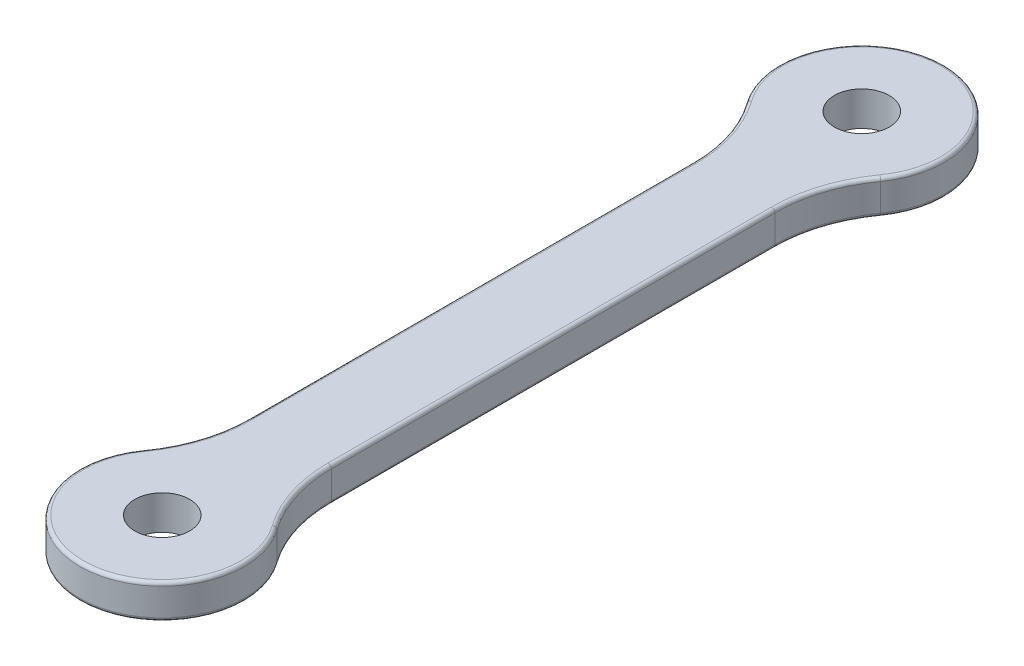
ISO-10303-21;
HEADER;
FILE_DESCRIPTION(('STEP AP214'),'2;1');
FILE_NAME('part.step','',(''),(''),'','','');
FILE_SCHEMA(('AUTOMOTIVE_DESIGN { 1 0 10303 214 1 1 1 1 }'));
ENDSEC;
DATA;
#1=APPLICATION_CONTEXT('core data for automotive mechanical design processes');
#2=APPLICATION_PROTOCOL_DEFINITION('international standard','automotive_design',2000,#1);
#3=PRODUCT_CONTEXT('',#1,'mechanical');
#4=PRODUCT('Part','Part','',(#3));
#5=PRODUCT_RELATED_PRODUCT_CATEGORY('part','',(#4));
#6=PRODUCT_DEFINITION_FORMATION('','',#4);
#7=PRODUCT_DEFINITION_CONTEXT('part definition',#1,'design');
#8=PRODUCT_DEFINITION('design','',#6,#7);
#9=PRODUCT_DEFINITION_SHAPE('','',#8);
#10=(LENGTH_UNIT() NAMED_UNIT(*) SI_UNIT(.MILLI.,.METRE.));
#11=(NAMED_UNIT(*) PLANE_ANGLE_UNIT() SI_UNIT($,.RADIAN.));
#12=(NAMED_UNIT(*) SI_UNIT($,.STERADIAN.) SOLID_ANGLE_UNIT());
#13=UNCERTAINTY_MEASURE_WITH_UNIT(LENGTH_MEASURE(1.E-05),#10,'distance_accuracy_value','');
#14=(GEOMETRIC_REPRESENTATION_CONTEXT(3) GLOBAL_UNCERTAINTY_ASSIGNED_CONTEXT((#13)) GLOBAL_UNIT_ASSIGNED_CONTEXT((#10,
#11,#12)) REPRESENTATION_CONTEXT('',''));
#15=CARTESIAN_POINT('',(0.,0.,0.));
#16=DIRECTION('',(0.,0.,1.));
#17=DIRECTION('',(1.,0.,0.));
#18=AXIS2_PLACEMENT_3D('',#15,#16,#17);
#19=CARTESIAN_POINT('',(0.,2.5,25.5));
#20=DIRECTION('',(0.,-1.,0.));
#21=DIRECTION('',(0.,0.,-1.));
#22=AXIS2_PLACEMENT_3D('',#19,#20,#21);
#23=CYLINDRICAL_SURFACE('',#22,6.);
#24=DIRECTION('',(0.,-1.,0.));
#25=VECTOR('',#24,1.);
#26=CARTESIAN_POINT('',(4.87500000000001,2.5,22.0022328550917));
#27=LINE('',#26,#25);
#28=CARTESIAN_POINT('',(4.87500000000001,0.25,22.0022328550917));
#29=VERTEX_POINT('',#28);
#30=CARTESIAN_POINT('',(4.87500000000001,2.25,22.0022328550917));
#31=VERTEX_POINT('',#30);
#32=EDGE_CURVE('E298',#29,#31,#27,.F.);
#33=ORIENTED_EDGE('',*,*,#32,.T.);
#34=CARTESIAN_POINT('',(0.,2.25,25.5));
#35=DIRECTION('',(0.,1.,0.));
#36=DIRECTION('',(0.,0.,1.));
#37=AXIS2_PLACEMENT_3D('',#34,#35,#36);
#38=CIRCLE('',#37,6.);
#39=CARTESIAN_POINT('',(-4.875,2.25,22.0022328550917));
#40=VERTEX_POINT('',#39);
#41=EDGE_CURVE('E192',#31,#40,#38,.F.);
#42=ORIENTED_EDGE('',*,*,#41,.T.);
#43=DIRECTION('',(0.,-1.,0.));
#44=VECTOR('',#43,1.);
#45=CARTESIAN_POINT('',(-4.875,2.5,22.0022328550917));
#46=LINE('',#45,#44);
#47=CARTESIAN_POINT('',(-4.875,0.25,22.0022328550917));
#48=VERTEX_POINT('',#47);
#49=EDGE_CURVE('E293',#40,#48,#46,.T.);
#50=ORIENTED_EDGE('',*,*,#49,.T.);
#51=CARTESIAN_POINT('',(0.,0.25,25.5));
#52=DIRECTION('',(0.,1.,0.));
#53=DIRECTION('',(0.,0.,1.));
#54=AXIS2_PLACEMENT_3D('',#51,#52,#53);
#55=CIRCLE('',#54,6.);
#56=EDGE_CURVE('E190',#48,#29,#55,.T.);
#57=ORIENTED_EDGE('',*,*,#56,.T.);
#58=EDGE_LOOP('',(#33,#42,#50,#57));
#59=FACE_BOUND('',#58,.T.);
#60=ADVANCED_FACE('F38',(#59),#23,.T.);
#61=CARTESIAN_POINT('',(3.,2.5,0.));
#62=DIRECTION('',(-1.,0.,0.));
#63=DIRECTION('',(0.,0.,1.));
#64=AXIS2_PLACEMENT_3D('',#61,#62,#63);
#65=PLANE('',#64);
#66=DIRECTION('',(0.,1.,0.));
#67=VECTOR('',#66,1.);
#68=CARTESIAN_POINT('',(3.,2.5,-16.1726209469112));
#69=LINE('',#68,#67);
#70=CARTESIAN_POINT('',(3.,0.25,-16.1726209469112));
#71=VERTEX_POINT('',#70);
#72=CARTESIAN_POINT('',(3.,2.25,-16.1726209469112));
#73=VERTEX_POINT('',#72);
#74=EDGE_CURVE('E174',#71,#73,#69,.T.);
#75=ORIENTED_EDGE('',*,*,#74,.T.);
#76=DIRECTION('',(0.,0.,-1.));
#77=VECTOR('',#76,1.);
#78=CARTESIAN_POINT('',(3.,2.25,16.1726209469112));
#79=LINE('',#78,#77);
#80=CARTESIAN_POINT('',(3.,2.25,16.1726209469112));
#81=VERTEX_POINT('',#80);
#82=EDGE_CURVE('E11',#73,#81,#79,.F.);
#83=ORIENTED_EDGE('',*,*,#82,.T.);
#84=DIRECTION('',(0.,1.,0.));
#85=VECTOR('',#84,1.);
#86=CARTESIAN_POINT('',(3.,0.,16.1726209469112));
#87=LINE('',#86,#85);
#88=CARTESIAN_POINT('',(3.,0.25,16.1726209469112));
#89=VERTEX_POINT('',#88);
#90=EDGE_CURVE('E305',#81,#89,#87,.F.);
#91=ORIENTED_EDGE('',*,*,#90,.T.);
#92=DIRECTION('',(0.,0.,-1.));
#93=VECTOR('',#92,1.);
#94=CARTESIAN_POINT('',(3.,0.25,0.));
#95=LINE('',#94,#93);
#96=EDGE_CURVE('E47',#89,#71,#95,.T.);
#97=ORIENTED_EDGE('',*,*,#96,.T.);
#98=EDGE_LOOP('',(#75,#83,#91,#97));
#99=FACE_BOUND('',#98,.T.);
#100=ADVANCED_FACE('F371',(#99),#65,.F.);
#101=CARTESIAN_POINT('',(0.,2.5,-25.5));
#102=DIRECTION('',(0.,-1.,0.));
#103=DIRECTION('',(0.,0.,-1.));
#104=AXIS2_PLACEMENT_3D('',#101,#102,#103);
#105=CYLINDRICAL_SURFACE('',#104,6.);
#106=DIRECTION('',(0.,-1.,0.));
#107=VECTOR('',#106,1.);
#108=CARTESIAN_POINT('',(-4.875,2.5,-22.0022328550917));
#109=LINE('',#108,#107);
#110=CARTESIAN_POINT('',(-4.875,0.25,-22.0022328550917));
#111=VERTEX_POINT('',#110);
#112=CARTESIAN_POINT('',(-4.875,2.25,-22.0022328550917));
#113=VERTEX_POINT('',#112);
#114=EDGE_CURVE('E286',#111,#113,#109,.F.);
#115=ORIENTED_EDGE('',*,*,#114,.T.);
#116=CARTESIAN_POINT('',(0.,2.25,-25.5));
#117=DIRECTION('',(0.,1.,0.));
#118=DIRECTION('',(0.,0.,1.));
#119=AXIS2_PLACEMENT_3D('',#116,#117,#118);
#120=CIRCLE('',#119,6.);
#121=CARTESIAN_POINT('',(4.87500000000001,2.25,-22.0022328550917));
#122=VERTEX_POINT('',#121);
#123=EDGE_CURVE('E208',#113,#122,#120,.F.);
#124=ORIENTED_EDGE('',*,*,#123,.T.);
#125=DIRECTION('',(0.,-1.,0.));
#126=VECTOR('',#125,1.);
#127=CARTESIAN_POINT('',(4.87500000000001,2.5,-22.0022328550917));
#128=LINE('',#127,#126);
#129=CARTESIAN_POINT('',(4.87500000000001,0.25,-22.0022328550917));
#130=VERTEX_POINT('',#129);
#131=EDGE_CURVE('E295',#122,#130,#128,.T.);
#132=ORIENTED_EDGE('',*,*,#131,.T.);
#133=CARTESIAN_POINT('',(0.,0.25,-25.5));
#134=DIRECTION('',(0.,1.,0.));
#135=DIRECTION('',(0.,0.,1.));
#136=AXIS2_PLACEMENT_3D('',#133,#134,#135);
#137=CIRCLE('',#136,6.);
#138=EDGE_CURVE('E206',#130,#111,#137,.T.);
#139=ORIENTED_EDGE('',*,*,#138,.T.);
#140=EDGE_LOOP('',(#115,#124,#132,#139));
#141=FACE_BOUND('',#140,.T.);
#142=ADVANCED_FACE('F376',(#141),#105,.T.);
#143=CARTESIAN_POINT('',(0.,2.5,25.5));
#144=DIRECTION('',(0.,-1.,0.));
#145=DIRECTION('',(0.,0.,-1.));
#146=AXIS2_PLACEMENT_3D('',#143,#144,#145);
#147=CYLINDRICAL_SURFACE('',#146,2.);
#148=CARTESIAN_POINT('',(0.,2.5,25.5));
#149=DIRECTION('',(0.,1.,0.));
#150=DIRECTION('',(0.,0.,1.));
#151=AXIS2_PLACEMENT_3D('',#148,#149,#150);
#152=CIRCLE('',#151,2.);
#153=CARTESIAN_POINT('',(0.,2.5,27.5));
#154=VERTEX_POINT('',#153);
#155=EDGE_CURVE('E336',#154,#154,#152,.T.);
#156=ORIENTED_EDGE('',*,*,#155,.T.);
#157=EDGE_LOOP('',(#156));
#158=FACE_BOUND('',#157,.T.);
#159=CARTESIAN_POINT('',(0.,0.,25.5));
#160=DIRECTION('',(0.,1.,0.));
#161=DIRECTION('',(0.,0.,1.));
#162=AXIS2_PLACEMENT_3D('',#159,#160,#161);
#163=CIRCLE('',#162,2.);
#164=CARTESIAN_POINT('',(0.,0.,27.5));
#165=VERTEX_POINT('',#164);
#166=EDGE_CURVE('E247',#165,#165,#163,.T.);
#167=ORIENTED_EDGE('',*,*,#166,.F.);
#168=EDGE_LOOP('',(#167));
#169=FACE_BOUND('',#168,.T.);
#170=ADVANCED_FACE('F347',(#158,#169),#147,.F.);
#171=CARTESIAN_POINT('',(-3.,2.5,0.));
#172=DIRECTION('',(-1.,0.,0.));
#173=DIRECTION('',(0.,0.,1.));
#174=AXIS2_PLACEMENT_3D('',#171,#172,#173);
#175=PLANE('',#174);
#176=DIRECTION('',(0.,-1.,0.));
#177=VECTOR('',#176,1.);
#178=CARTESIAN_POINT('',(-3.,2.5,16.1726209469112));
#179=LINE('',#178,#177);
#180=CARTESIAN_POINT('',(-3.,0.25,16.1726209469112));
#181=VERTEX_POINT('',#180);
#182=CARTESIAN_POINT('',(-3.,2.25,16.1726209469112));
#183=VERTEX_POINT('',#182);
#184=EDGE_CURVE('E292',#181,#183,#179,.F.);
#185=ORIENTED_EDGE('',*,*,#184,.T.);
#186=DIRECTION('',(0.,0.,-1.));
#187=VECTOR('',#186,1.);
#188=CARTESIAN_POINT('',(-3.,2.25,0.));
#189=LINE('',#188,#187);
#190=CARTESIAN_POINT('',(-3.,2.25,-16.1726209469112));
#191=VERTEX_POINT('',#190);
#192=EDGE_CURVE('E200',#183,#191,#189,.T.);
#193=ORIENTED_EDGE('',*,*,#192,.T.);
#194=DIRECTION('',(0.,-1.,0.));
#195=VECTOR('',#194,1.);
#196=CARTESIAN_POINT('',(-3.,2.5,-16.1726209469112));
#197=LINE('',#196,#195);
#198=CARTESIAN_POINT('',(-3.,0.25,-16.1726209469112));
#199=VERTEX_POINT('',#198);
#200=EDGE_CURVE('E283',#191,#199,#197,.T.);
#201=ORIENTED_EDGE('',*,*,#200,.T.);
#202=DIRECTION('',(0.,0.,-1.));
#203=VECTOR('',#202,1.);
#204=CARTESIAN_POINT('',(-3.,0.25,16.1726209469112));
#205=LINE('',#204,#203);
#206=EDGE_CURVE('E198',#199,#181,#205,.F.);
#207=ORIENTED_EDGE('',*,*,#206,.T.);
#208=EDGE_LOOP('',(#185,#193,#201,#207));
#209=FACE_BOUND('',#208,.T.);
#210=ADVANCED_FACE('F289',(#209),#175,.T.);
#211=CARTESIAN_POINT('',(0.,2.5,-25.5));
#212=DIRECTION('',(0.,-1.,0.));
#213=DIRECTION('',(0.,0.,-1.));
#214=AXIS2_PLACEMENT_3D('',#211,#212,#213);
#215=CYLINDRICAL_SURFACE('',#214,2.);
#216=CARTESIAN_POINT('',(0.,2.5,-25.5));
#217=DIRECTION('',(0.,1.,0.));
#218=DIRECTION('',(0.,0.,1.));
#219=AXIS2_PLACEMENT_3D('',#216,#217,#218);
#220=CIRCLE('',#219,2.);
#221=CARTESIAN_POINT('',(0.,2.5,-23.5));
#222=VERTEX_POINT('',#221);
#223=EDGE_CURVE('E334',#222,#222,#220,.T.);
#224=ORIENTED_EDGE('',*,*,#223,.T.);
#225=EDGE_LOOP('',(#224));
#226=FACE_BOUND('',#225,.T.);
#227=CARTESIAN_POINT('',(0.,0.,-25.5));
#228=DIRECTION('',(0.,1.,0.));
#229=DIRECTION('',(0.,0.,1.));
#230=AXIS2_PLACEMENT_3D('',#227,#228,#229);
#231=CIRCLE('',#230,2.);
#232=CARTESIAN_POINT('',(0.,0.,-23.5));
#233=VERTEX_POINT('',#232);
#234=EDGE_CURVE('E339',#233,#233,#231,.T.);
#235=ORIENTED_EDGE('',*,*,#234,.F.);
#236=EDGE_LOOP('',(#235));
#237=FACE_BOUND('',#236,.T.);
#238=ADVANCED_FACE('F352',(#226,#237),#215,.F.);
#239=CARTESIAN_POINT('',(0.,2.5,0.));
#240=DIRECTION('',(0.,1.,0.));
#241=DIRECTION('',(0.,0.,1.));
#242=AXIS2_PLACEMENT_3D('',#239,#240,#241);
#243=PLANE('',#242);
#244=CARTESIAN_POINT('',(0.,2.5,25.5));
#245=DIRECTION('',(0.,1.,0.));
#246=DIRECTION('',(0.,0.,1.));
#247=AXIS2_PLACEMENT_3D('',#244,#245,#246);
#248=CIRCLE('',#247,5.75);
#249=CARTESIAN_POINT('',(-4.671875,2.5,22.1479731527962));
#250=VERTEX_POINT('',#249);
#251=CARTESIAN_POINT('',(4.671875,2.5,22.1479731527962));
#252=VERTEX_POINT('',#251);
#253=EDGE_CURVE('E179',#250,#252,#248,.T.);
#254=ORIENTED_EDGE('',*,*,#253,.T.);
#255=CARTESIAN_POINT('',(13.,2.5,16.1726209469112));
#256=DIRECTION('',(0.,1.,0.));
#257=DIRECTION('',(0.,0.,1.));
#258=AXIS2_PLACEMENT_3D('',#255,#256,#257);
#259=CIRCLE('',#258,10.25);
#260=CARTESIAN_POINT('',(2.75,2.5,16.1726209469112));
#261=VERTEX_POINT('',#260);
#262=EDGE_CURVE('E159',#252,#261,#259,.F.);
#263=ORIENTED_EDGE('',*,*,#262,.T.);
#264=DIRECTION('',(0.,0.,-1.));
#265=VECTOR('',#264,1.);
#266=CARTESIAN_POINT('',(2.75,2.5,-16.1726209469112));
#267=LINE('',#266,#265);
#268=CARTESIAN_POINT('',(2.75,2.5,-16.1726209469112));
#269=VERTEX_POINT('',#268);
#270=EDGE_CURVE('E167',#261,#269,#267,.T.);
#271=ORIENTED_EDGE('',*,*,#270,.T.);
#272=CARTESIAN_POINT('',(13.,2.5,-16.1726209469112));
#273=DIRECTION('',(0.,1.,0.));
#274=DIRECTION('',(0.,0.,1.));
#275=AXIS2_PLACEMENT_3D('',#272,#273,#274);
#276=CIRCLE('',#275,10.25);
#277=CARTESIAN_POINT('',(4.671875,2.5,-22.1479731527962));
#278=VERTEX_POINT('',#277);
#279=EDGE_CURVE('E173',#269,#278,#276,.F.);
#280=ORIENTED_EDGE('',*,*,#279,.T.);
#281=CARTESIAN_POINT('',(0.,2.5,-25.5));
#282=DIRECTION('',(0.,1.,0.));
#283=DIRECTION('',(0.,0.,1.));
#284=AXIS2_PLACEMENT_3D('',#281,#282,#283);
#285=CIRCLE('',#284,5.75);
#286=CARTESIAN_POINT('',(-4.671875,2.5,-22.1479731527962));
#287=VERTEX_POINT('',#286);
#288=EDGE_CURVE('E311',#278,#287,#285,.T.);
#289=ORIENTED_EDGE('',*,*,#288,.T.);
#290=CARTESIAN_POINT('',(-13.,2.5,-16.1726209469112));
#291=DIRECTION('',(0.,1.,0.));
#292=DIRECTION('',(0.,0.,1.));
#293=AXIS2_PLACEMENT_3D('',#290,#291,#292);
#294=CIRCLE('',#293,10.25);
#295=CARTESIAN_POINT('',(-2.75,2.5,-16.1726209469112));
#296=VERTEX_POINT('',#295);
#297=EDGE_CURVE('E313',#287,#296,#294,.F.);
#298=ORIENTED_EDGE('',*,*,#297,.T.);
#299=DIRECTION('',(0.,0.,-1.));
#300=VECTOR('',#299,1.);
#301=CARTESIAN_POINT('',(-2.75,2.5,0.));
#302=LINE('',#301,#300);
#303=CARTESIAN_POINT('',(-2.75,2.5,16.1726209469112));
#304=VERTEX_POINT('',#303);
#305=EDGE_CURVE('E315',#296,#304,#302,.F.);
#306=ORIENTED_EDGE('',*,*,#305,.T.);
#307=CARTESIAN_POINT('',(-13.,2.5,16.1726209469112));
#308=DIRECTION('',(0.,1.,0.));
#309=DIRECTION('',(0.,0.,1.));
#310=AXIS2_PLACEMENT_3D('',#307,#308,#309);
#311=CIRCLE('',#310,10.25);
#312=EDGE_CURVE('E185',#304,#250,#311,.F.);
#313=ORIENTED_EDGE('',*,*,#312,.T.);
#314=EDGE_LOOP('',(#254,#263,#271,#280,#289,#298,#306,#313));
#315=FACE_BOUND('',#314,.T.);
#316=ORIENTED_EDGE('',*,*,#155,.F.);
#317=EDGE_LOOP('',(#316));
#318=FACE_BOUND('',#317,.T.);
#319=ORIENTED_EDGE('',*,*,#223,.F.);
#320=EDGE_LOOP('',(#319));
#321=FACE_BOUND('',#320,.T.);
#322=ADVANCED_FACE('F176',(#315,#318,#321),#243,.T.);
#323=CARTESIAN_POINT('',(0.,0.,0.));
#324=DIRECTION('',(0.,1.,0.));
#325=DIRECTION('',(0.,0.,1.));
#326=AXIS2_PLACEMENT_3D('',#323,#324,#325);
#327=PLANE('',#326);
#328=DIRECTION('',(0.,0.,-1.));
#329=VECTOR('',#328,1.);
#330=CARTESIAN_POINT('',(2.75,0.,0.));
#331=LINE('',#330,#329);
#332=CARTESIAN_POINT('',(2.75,0.,-16.1726209469112));
#333=VERTEX_POINT('',#332);
#334=CARTESIAN_POINT('',(2.75,0.,16.1726209469112));
#335=VERTEX_POINT('',#334);
#336=EDGE_CURVE('E214',#333,#335,#331,.F.);
#337=ORIENTED_EDGE('',*,*,#336,.T.);
#338=CARTESIAN_POINT('',(13.,0.,16.1726209469112));
#339=DIRECTION('',(0.,1.,0.));
#340=DIRECTION('',(0.,0.,1.));
#341=AXIS2_PLACEMENT_3D('',#338,#339,#340);
#342=CIRCLE('',#341,10.25);
#343=CARTESIAN_POINT('',(4.671875,0.,22.1479731527962));
#344=VERTEX_POINT('',#343);
#345=EDGE_CURVE('E227',#335,#344,#342,.T.);
#346=ORIENTED_EDGE('',*,*,#345,.T.);
#347=CARTESIAN_POINT('',(0.,0.,25.5));
#348=DIRECTION('',(0.,1.,0.));
#349=DIRECTION('',(0.,0.,1.));
#350=AXIS2_PLACEMENT_3D('',#347,#348,#349);
#351=CIRCLE('',#350,5.75);
#352=CARTESIAN_POINT('',(-4.671875,0.,22.1479731527962));
#353=VERTEX_POINT('',#352);
#354=EDGE_CURVE('E62',#344,#353,#351,.F.);
#355=ORIENTED_EDGE('',*,*,#354,.T.);
#356=CARTESIAN_POINT('',(-13.,0.,16.1726209469112));
#357=DIRECTION('',(0.,1.,0.));
#358=DIRECTION('',(0.,0.,1.));
#359=AXIS2_PLACEMENT_3D('',#356,#357,#358);
#360=CIRCLE('',#359,10.25);
#361=CARTESIAN_POINT('',(-2.75,0.,16.1726209469112));
#362=VERTEX_POINT('',#361);
#363=EDGE_CURVE('E224',#353,#362,#360,.T.);
#364=ORIENTED_EDGE('',*,*,#363,.T.);
#365=DIRECTION('',(0.,0.,-1.));
#366=VECTOR('',#365,1.);
#367=CARTESIAN_POINT('',(-2.75,0.,-16.1726209469112));
#368=LINE('',#367,#366);
#369=CARTESIAN_POINT('',(-2.75,0.,-16.1726209469112));
#370=VERTEX_POINT('',#369);
#371=EDGE_CURVE('E222',#362,#370,#368,.T.);
#372=ORIENTED_EDGE('',*,*,#371,.T.);
#373=CARTESIAN_POINT('',(-13.,0.,-16.1726209469112));
#374=DIRECTION('',(0.,1.,0.));
#375=DIRECTION('',(0.,0.,1.));
#376=AXIS2_PLACEMENT_3D('',#373,#374,#375);
#377=CIRCLE('',#376,10.25);
#378=CARTESIAN_POINT('',(-4.671875,0.,-22.1479731527962));
#379=VERTEX_POINT('',#378);
#380=EDGE_CURVE('E220',#370,#379,#377,.T.);
#381=ORIENTED_EDGE('',*,*,#380,.T.);
#382=CARTESIAN_POINT('',(0.,0.,-25.5));
#383=DIRECTION('',(0.,1.,0.));
#384=DIRECTION('',(0.,0.,1.));
#385=AXIS2_PLACEMENT_3D('',#382,#383,#384);
#386=CIRCLE('',#385,5.75);
#387=CARTESIAN_POINT('',(4.671875,0.,-22.1479731527962));
#388=VERTEX_POINT('',#387);
#389=EDGE_CURVE('E218',#379,#388,#386,.F.);
#390=ORIENTED_EDGE('',*,*,#389,.T.);
#391=CARTESIAN_POINT('',(13.,0.,-16.1726209469112));
#392=DIRECTION('',(0.,1.,0.));
#393=DIRECTION('',(0.,0.,1.));
#394=AXIS2_PLACEMENT_3D('',#391,#392,#393);
#395=CIRCLE('',#394,10.25);
#396=EDGE_CURVE('E216',#388,#333,#395,.T.);
#397=ORIENTED_EDGE('',*,*,#396,.T.);
#398=EDGE_LOOP('',(#337,#346,#355,#364,#372,#381,#390,#397));
#399=FACE_BOUND('',#398,.T.);
#400=ORIENTED_EDGE('',*,*,#166,.T.);
#401=EDGE_LOOP('',(#400));
#402=FACE_BOUND('',#401,.T.);
#403=ORIENTED_EDGE('',*,*,#234,.T.);
#404=EDGE_LOOP('',(#403));
#405=FACE_BOUND('',#404,.T.);
#406=ADVANCED_FACE('F351',(#399,#402,#405),#327,.F.);
#407=CARTESIAN_POINT('',(-13.,2.5,16.1726209469112));
#408=DIRECTION('',(0.,-1.,0.));
#409=DIRECTION('',(0.,0.,-1.));
#410=AXIS2_PLACEMENT_3D('',#407,#408,#409);
#411=CYLINDRICAL_SURFACE('',#410,10.);
#412=ORIENTED_EDGE('',*,*,#49,.F.);
#413=CARTESIAN_POINT('',(-13.,2.25,16.1726209469112));
#414=DIRECTION('',(0.,1.,0.));
#415=DIRECTION('',(0.,0.,1.));
#416=AXIS2_PLACEMENT_3D('',#413,#414,#415);
#417=CIRCLE('',#416,10.);
#418=EDGE_CURVE('E196',#40,#183,#417,.T.);
#419=ORIENTED_EDGE('',*,*,#418,.T.);
#420=ORIENTED_EDGE('',*,*,#184,.F.);
#421=CARTESIAN_POINT('',(-13.,0.25,16.1726209469112));
#422=DIRECTION('',(0.,1.,0.));
#423=DIRECTION('',(0.,0.,1.));
#424=AXIS2_PLACEMENT_3D('',#421,#422,#423);
#425=CIRCLE('',#424,10.);
#426=EDGE_CURVE('E194',#181,#48,#425,.F.);
#427=ORIENTED_EDGE('',*,*,#426,.T.);
#428=EDGE_LOOP('',(#412,#419,#420,#427));
#429=FACE_BOUND('',#428,.T.);
#430=ADVANCED_FACE('F362',(#429),#411,.F.);
#431=CARTESIAN_POINT('',(-13.,2.5,-16.1726209469112));
#432=DIRECTION('',(0.,-1.,0.));
#433=DIRECTION('',(0.,0.,-1.));
#434=AXIS2_PLACEMENT_3D('',#431,#432,#433);
#435=CYLINDRICAL_SURFACE('',#434,10.);
#436=ORIENTED_EDGE('',*,*,#200,.F.);
#437=CARTESIAN_POINT('',(-13.,2.25,-16.1726209469112));
#438=DIRECTION('',(0.,1.,0.));
#439=DIRECTION('',(0.,0.,1.));
#440=AXIS2_PLACEMENT_3D('',#437,#438,#439);
#441=CIRCLE('',#440,10.);
#442=EDGE_CURVE('E204',#191,#113,#441,.T.);
#443=ORIENTED_EDGE('',*,*,#442,.T.);
#444=ORIENTED_EDGE('',*,*,#114,.F.);
#445=CARTESIAN_POINT('',(-13.,0.25,-16.1726209469112));
#446=DIRECTION('',(0.,1.,0.));
#447=DIRECTION('',(0.,0.,1.));
#448=AXIS2_PLACEMENT_3D('',#445,#446,#447);
#449=CIRCLE('',#448,10.);
#450=EDGE_CURVE('E202',#111,#199,#449,.F.);
#451=ORIENTED_EDGE('',*,*,#450,.T.);
#452=EDGE_LOOP('',(#436,#443,#444,#451));
#453=FACE_BOUND('',#452,.T.);
#454=ADVANCED_FACE('F282',(#453),#435,.F.);
#455=CARTESIAN_POINT('',(13.,2.5,-16.1726209469112));
#456=DIRECTION('',(0.,-1.,0.));
#457=DIRECTION('',(0.,0.,-1.));
#458=AXIS2_PLACEMENT_3D('',#455,#456,#457);
#459=CYLINDRICAL_SURFACE('',#458,10.);
#460=ORIENTED_EDGE('',*,*,#131,.F.);
#461=CARTESIAN_POINT('',(13.,2.25,-16.1726209469112));
#462=DIRECTION('',(0.,1.,0.));
#463=DIRECTION('',(0.,0.,1.));
#464=AXIS2_PLACEMENT_3D('',#461,#462,#463);
#465=CIRCLE('',#464,10.);
#466=EDGE_CURVE('E212',#122,#73,#465,.T.);
#467=ORIENTED_EDGE('',*,*,#466,.T.);
#468=ORIENTED_EDGE('',*,*,#74,.F.);
#469=CARTESIAN_POINT('',(13.,0.25,-16.1726209469112));
#470=DIRECTION('',(0.,1.,0.));
#471=DIRECTION('',(0.,0.,1.));
#472=AXIS2_PLACEMENT_3D('',#469,#470,#471);
#473=CIRCLE('',#472,10.);
#474=EDGE_CURVE('E210',#71,#130,#473,.F.);
#475=ORIENTED_EDGE('',*,*,#474,.T.);
#476=EDGE_LOOP('',(#460,#467,#468,#475));
#477=FACE_BOUND('',#476,.T.);
#478=ADVANCED_FACE('F383',(#477),#459,.F.);
#479=CARTESIAN_POINT('',(13.,2.5,16.1726209469112));
#480=DIRECTION('',(0.,-1.,0.));
#481=DIRECTION('',(0.,0.,-1.));
#482=AXIS2_PLACEMENT_3D('',#479,#480,#481);
#483=CYLINDRICAL_SURFACE('',#482,10.);
#484=ORIENTED_EDGE('',*,*,#90,.F.);
#485=CARTESIAN_POINT('',(13.,2.25,16.1726209469112));
#486=DIRECTION('',(0.,1.,0.));
#487=DIRECTION('',(0.,0.,1.));
#488=AXIS2_PLACEMENT_3D('',#485,#486,#487);
#489=CIRCLE('',#488,10.);
#490=EDGE_CURVE('E161',#81,#31,#489,.T.);
#491=ORIENTED_EDGE('',*,*,#490,.T.);
#492=ORIENTED_EDGE('',*,*,#32,.F.);
#493=CARTESIAN_POINT('',(13.,0.25,16.1726209469112));
#494=DIRECTION('',(0.,1.,0.));
#495=DIRECTION('',(0.,0.,1.));
#496=AXIS2_PLACEMENT_3D('',#493,#494,#495);
#497=CIRCLE('',#496,10.);
#498=EDGE_CURVE('E181',#29,#89,#497,.F.);
#499=ORIENTED_EDGE('',*,*,#498,.T.);
#500=EDGE_LOOP('',(#484,#491,#492,#499));
#501=FACE_BOUND('',#500,.T.);
#502=ADVANCED_FACE('F332',(#501),#483,.F.);
#503=CARTESIAN_POINT('',(-13.,2.25,-16.1726209469112));
#504=DIRECTION('',(0.,1.,0.));
#505=DIRECTION('',(0.,0.,1.));
#506=AXIS2_PLACEMENT_3D('',#503,#504,#505);
#507=TOROIDAL_SURFACE('',#506,10.25,0.25);
#508=CARTESIAN_POINT('',(-4.67187499999999,2.25,-22.1479731527962));
#509=DIRECTION('',(-0.582961190818049,0.,-0.812500000000001));
#510=DIRECTION('',(-0.812500000000001,0.,0.582961190818049));
#511=AXIS2_PLACEMENT_3D('',#508,#509,#510);
#512=CIRCLE('',#511,0.25);
#513=EDGE_CURVE('E241',#113,#287,#512,.T.);
#514=ORIENTED_EDGE('',*,*,#513,.F.);
#515=ORIENTED_EDGE('',*,*,#442,.F.);
#516=CARTESIAN_POINT('',(-2.75,2.25,-16.1726209469112));
#517=DIRECTION('',(0.,0.,1.));
#518=DIRECTION('',(1.,0.,0.));
#519=AXIS2_PLACEMENT_3D('',#516,#517,#518);
#520=CIRCLE('',#519,0.25);
#521=EDGE_CURVE('E244',#296,#191,#520,.T.);
#522=ORIENTED_EDGE('',*,*,#521,.F.);
#523=ORIENTED_EDGE('',*,*,#297,.F.);
#524=EDGE_LOOP('',(#514,#515,#522,#523));
#525=FACE_BOUND('',#524,.T.);
#526=ADVANCED_FACE('F389',(#525),#507,.T.);
#527=CARTESIAN_POINT('',(-2.75,2.25,0.));
#528=DIRECTION('',(0.,0.,-1.));
#529=DIRECTION('',(-1.,0.,0.));
#530=AXIS2_PLACEMENT_3D('',#527,#528,#529);
#531=CYLINDRICAL_SURFACE('',#530,0.25);
#532=ORIENTED_EDGE('',*,*,#521,.T.);
#533=ORIENTED_EDGE('',*,*,#192,.F.);
#534=CARTESIAN_POINT('',(-2.75,2.25,16.1726209469112));
#535=DIRECTION('',(0.,0.,1.));
#536=DIRECTION('',(1.,0.,0.));
#537=AXIS2_PLACEMENT_3D('',#534,#535,#536);
#538=CIRCLE('',#537,0.25);
#539=EDGE_CURVE('E238',#304,#183,#538,.T.);
#540=ORIENTED_EDGE('',*,*,#539,.F.);
#541=ORIENTED_EDGE('',*,*,#305,.F.);
#542=EDGE_LOOP('',(#532,#533,#540,#541));
#543=FACE_BOUND('',#542,.T.);
#544=ADVANCED_FACE('F405',(#543),#531,.T.);
#545=CARTESIAN_POINT('',(0.,2.25,-25.5));
#546=DIRECTION('',(0.,1.,0.));
#547=DIRECTION('',(0.,0.,1.));
#548=AXIS2_PLACEMENT_3D('',#545,#546,#547);
#549=TOROIDAL_SURFACE('',#548,5.75,0.25);
#550=ORIENTED_EDGE('',*,*,#513,.T.);
#551=ORIENTED_EDGE('',*,*,#288,.F.);
#552=CARTESIAN_POINT('',(4.67187500000001,2.25,-22.1479731527962));
#553=DIRECTION('',(-0.582961190818049,0.,0.812500000000001));
#554=DIRECTION('',(0.812500000000001,0.,0.582961190818049));
#555=AXIS2_PLACEMENT_3D('',#552,#553,#554);
#556=CIRCLE('',#555,0.25);
#557=EDGE_CURVE('E235',#122,#278,#556,.T.);
#558=ORIENTED_EDGE('',*,*,#557,.F.);
#559=ORIENTED_EDGE('',*,*,#123,.F.);
#560=EDGE_LOOP('',(#550,#551,#558,#559));
#561=FACE_BOUND('',#560,.T.);
#562=ADVANCED_FACE('F402',(#561),#549,.T.);
#563=CARTESIAN_POINT('',(-13.,2.25,16.1726209469112));
#564=DIRECTION('',(0.,1.,0.));
#565=DIRECTION('',(0.,0.,1.));
#566=AXIS2_PLACEMENT_3D('',#563,#564,#565);
#567=TOROIDAL_SURFACE('',#566,10.25,0.25);
#568=ORIENTED_EDGE('',*,*,#539,.T.);
#569=ORIENTED_EDGE('',*,*,#418,.F.);
#570=CARTESIAN_POINT('',(-4.671875,2.25,22.1479731527962));
#571=DIRECTION('',(-0.582961190818052,0.,0.812499999999999));
#572=DIRECTION('',(0.812499999999999,0.,0.582961190818052));
#573=AXIS2_PLACEMENT_3D('',#570,#571,#572);
#574=CIRCLE('',#573,0.25);
#575=EDGE_CURVE('E232',#250,#40,#574,.T.);
#576=ORIENTED_EDGE('',*,*,#575,.F.);
#577=ORIENTED_EDGE('',*,*,#312,.F.);
#578=EDGE_LOOP('',(#568,#569,#576,#577));
#579=FACE_BOUND('',#578,.T.);
#580=ADVANCED_FACE('F322',(#579),#567,.T.);
#581=CARTESIAN_POINT('',(13.,2.25,-16.1726209469112));
#582=DIRECTION('',(0.,1.,0.));
#583=DIRECTION('',(0.,0.,1.));
#584=AXIS2_PLACEMENT_3D('',#581,#582,#583);
#585=TOROIDAL_SURFACE('',#584,10.25,0.25);
#586=ORIENTED_EDGE('',*,*,#557,.T.);
#587=ORIENTED_EDGE('',*,*,#279,.F.);
#588=CARTESIAN_POINT('',(2.75,2.25,-16.1726209469112));
#589=DIRECTION('',(0.,0.,1.));
#590=DIRECTION('',(1.,0.,0.));
#591=AXIS2_PLACEMENT_3D('',#588,#589,#590);
#592=CIRCLE('',#591,0.25);
#593=EDGE_CURVE('E170',#73,#269,#592,.T.);
#594=ORIENTED_EDGE('',*,*,#593,.F.);
#595=ORIENTED_EDGE('',*,*,#466,.F.);
#596=EDGE_LOOP('',(#586,#587,#594,#595));
#597=FACE_BOUND('',#596,.T.);
#598=ADVANCED_FACE('F396',(#597),#585,.T.);
#599=CARTESIAN_POINT('',(0.,2.25,25.5));
#600=DIRECTION('',(0.,1.,0.));
#601=DIRECTION('',(0.,0.,1.));
#602=AXIS2_PLACEMENT_3D('',#599,#600,#601);
#603=TOROIDAL_SURFACE('',#602,5.75,0.25);
#604=ORIENTED_EDGE('',*,*,#575,.T.);
#605=ORIENTED_EDGE('',*,*,#41,.F.);
#606=CARTESIAN_POINT('',(4.671875,2.25,22.1479731527962));
#607=DIRECTION('',(-0.582961190818047,0.,-0.812500000000003));
#608=DIRECTION('',(-0.812500000000003,0.,0.582961190818047));
#609=AXIS2_PLACEMENT_3D('',#606,#607,#608);
#610=CIRCLE('',#609,0.25);
#611=EDGE_CURVE('E164',#252,#31,#610,.T.);
#612=ORIENTED_EDGE('',*,*,#611,.F.);
#613=ORIENTED_EDGE('',*,*,#253,.F.);
#614=EDGE_LOOP('',(#604,#605,#612,#613));
#615=FACE_BOUND('',#614,.T.);
#616=ADVANCED_FACE('F325',(#615),#603,.T.);
#617=CARTESIAN_POINT('',(2.75,2.25,0.));
#618=DIRECTION('',(0.,0.,1.));
#619=DIRECTION('',(1.,0.,0.));
#620=AXIS2_PLACEMENT_3D('',#617,#618,#619);
#621=CYLINDRICAL_SURFACE('',#620,0.25);
#622=ORIENTED_EDGE('',*,*,#593,.T.);
#623=ORIENTED_EDGE('',*,*,#270,.F.);
#624=CARTESIAN_POINT('',(2.75,2.25,16.1726209469112));
#625=DIRECTION('',(0.,0.,1.));
#626=DIRECTION('',(1.,0.,0.));
#627=AXIS2_PLACEMENT_3D('',#624,#625,#626);
#628=CIRCLE('',#627,0.25);
#629=EDGE_CURVE('E155',#81,#261,#628,.T.);
#630=ORIENTED_EDGE('',*,*,#629,.F.);
#631=ORIENTED_EDGE('',*,*,#82,.F.);
#632=EDGE_LOOP('',(#622,#623,#630,#631));
#633=FACE_BOUND('',#632,.T.);
#634=ADVANCED_FACE('F168',(#633),#621,.T.);
#635=CARTESIAN_POINT('',(13.,2.25,16.1726209469112));
#636=DIRECTION('',(0.,1.,0.));
#637=DIRECTION('',(0.,0.,1.));
#638=AXIS2_PLACEMENT_3D('',#635,#636,#637);
#639=TOROIDAL_SURFACE('',#638,10.25,0.25);
#640=ORIENTED_EDGE('',*,*,#611,.T.);
#641=ORIENTED_EDGE('',*,*,#490,.F.);
#642=ORIENTED_EDGE('',*,*,#629,.T.);
#643=ORIENTED_EDGE('',*,*,#262,.F.);
#644=EDGE_LOOP('',(#640,#641,#642,#643));
#645=FACE_BOUND('',#644,.T.);
#646=ADVANCED_FACE('F157',(#645),#639,.T.);
#647=CARTESIAN_POINT('',(-13.,0.25,-16.1726209469112));
#648=DIRECTION('',(0.,1.,0.));
#649=DIRECTION('',(0.,0.,1.));
#650=AXIS2_PLACEMENT_3D('',#647,#648,#649);
#651=TOROIDAL_SURFACE('',#650,10.25,0.25);
#652=CARTESIAN_POINT('',(-2.75,0.25,-16.1726209469112));
#653=DIRECTION('',(0.,0.,1.));
#654=DIRECTION('',(1.,0.,0.));
#655=AXIS2_PLACEMENT_3D('',#652,#653,#654);
#656=CIRCLE('',#655,0.25);
#657=EDGE_CURVE('E262',#199,#370,#656,.T.);
#658=ORIENTED_EDGE('',*,*,#657,.F.);
#659=ORIENTED_EDGE('',*,*,#450,.F.);
#660=CARTESIAN_POINT('',(-4.671875,0.25,-22.1479731527962));
#661=DIRECTION('',(-0.582961190818052,0.,-0.812499999999999));
#662=DIRECTION('',(-0.812499999999999,0.,0.582961190818052));
#663=AXIS2_PLACEMENT_3D('',#660,#661,#662);
#664=CIRCLE('',#663,0.25);
#665=EDGE_CURVE('E42',#379,#111,#664,.T.);
#666=ORIENTED_EDGE('',*,*,#665,.F.);
#667=ORIENTED_EDGE('',*,*,#380,.F.);
#668=EDGE_LOOP('',(#658,#659,#666,#667));
#669=FACE_BOUND('',#668,.T.);
#670=ADVANCED_FACE('F40',(#669),#651,.T.);
#671=CARTESIAN_POINT('',(0.,0.25,-25.5));
#672=DIRECTION('',(0.,1.,0.));
#673=DIRECTION('',(0.,0.,1.));
#674=AXIS2_PLACEMENT_3D('',#671,#672,#673);
#675=TOROIDAL_SURFACE('',#674,5.75,0.25);
#676=ORIENTED_EDGE('',*,*,#665,.T.);
#677=ORIENTED_EDGE('',*,*,#138,.F.);
#678=CARTESIAN_POINT('',(4.67187500000001,0.25,-22.1479731527962));
#679=DIRECTION('',(-0.582961190818049,0.,0.812500000000001));
#680=DIRECTION('',(0.812500000000001,0.,0.582961190818049));
#681=AXIS2_PLACEMENT_3D('',#678,#679,#680);
#682=CIRCLE('',#681,0.25);
#683=EDGE_CURVE('E260',#388,#130,#682,.T.);
#684=ORIENTED_EDGE('',*,*,#683,.F.);
#685=ORIENTED_EDGE('',*,*,#389,.F.);
#686=EDGE_LOOP('',(#676,#677,#684,#685));
#687=FACE_BOUND('',#686,.T.);
#688=ADVANCED_FACE('F273',(#687),#675,.T.);
#689=CARTESIAN_POINT('',(-2.75,0.25,0.));
#690=DIRECTION('',(0.,0.,1.));
#691=DIRECTION('',(1.,0.,0.));
#692=AXIS2_PLACEMENT_3D('',#689,#690,#691);
#693=CYLINDRICAL_SURFACE('',#692,0.25);
#694=ORIENTED_EDGE('',*,*,#657,.T.);
#695=ORIENTED_EDGE('',*,*,#371,.F.);
#696=CARTESIAN_POINT('',(-2.75,0.25,16.1726209469112));
#697=DIRECTION('',(0.,0.,1.));
#698=DIRECTION('',(1.,0.,0.));
#699=AXIS2_PLACEMENT_3D('',#696,#697,#698);
#700=CIRCLE('',#699,0.25);
#701=EDGE_CURVE('E257',#181,#362,#700,.T.);
#702=ORIENTED_EDGE('',*,*,#701,.F.);
#703=ORIENTED_EDGE('',*,*,#206,.F.);
#704=EDGE_LOOP('',(#694,#695,#702,#703));
#705=FACE_BOUND('',#704,.T.);
#706=ADVANCED_FACE('F431',(#705),#693,.T.);
#707=CARTESIAN_POINT('',(13.,0.25,-16.1726209469112));
#708=DIRECTION('',(0.,1.,0.));
#709=DIRECTION('',(0.,0.,1.));
#710=AXIS2_PLACEMENT_3D('',#707,#708,#709);
#711=TOROIDAL_SURFACE('',#710,10.25,0.25);
#712=ORIENTED_EDGE('',*,*,#683,.T.);
#713=ORIENTED_EDGE('',*,*,#474,.F.);
#714=CARTESIAN_POINT('',(2.75,0.25,-16.1726209469112));
#715=DIRECTION('',(0.,0.,1.));
#716=DIRECTION('',(1.,0.,0.));
#717=AXIS2_PLACEMENT_3D('',#714,#715,#716);
#718=CIRCLE('',#717,0.25);
#719=EDGE_CURVE('E254',#333,#71,#718,.T.);
#720=ORIENTED_EDGE('',*,*,#719,.F.);
#721=ORIENTED_EDGE('',*,*,#396,.F.);
#722=EDGE_LOOP('',(#712,#713,#720,#721));
#723=FACE_BOUND('',#722,.T.);
#724=ADVANCED_FACE('F427',(#723),#711,.T.);
#725=CARTESIAN_POINT('',(-13.,0.25,16.1726209469112));
#726=DIRECTION('',(0.,1.,0.));
#727=DIRECTION('',(0.,0.,1.));
#728=AXIS2_PLACEMENT_3D('',#725,#726,#727);
#729=TOROIDAL_SURFACE('',#728,10.25,0.25);
#730=ORIENTED_EDGE('',*,*,#701,.T.);
#731=ORIENTED_EDGE('',*,*,#363,.F.);
#732=CARTESIAN_POINT('',(-4.67187499999999,0.25,22.1479731527962));
#733=DIRECTION('',(-0.582961190818049,0.,0.812500000000001));
#734=DIRECTION('',(0.812500000000001,0.,0.582961190818049));
#735=AXIS2_PLACEMENT_3D('',#732,#733,#734);
#736=CIRCLE('',#735,0.25);
#737=EDGE_CURVE('E251',#48,#353,#736,.T.);
#738=ORIENTED_EDGE('',*,*,#737,.F.);
#739=ORIENTED_EDGE('',*,*,#426,.F.);
#740=EDGE_LOOP('',(#730,#731,#738,#739));
#741=FACE_BOUND('',#740,.T.);
#742=ADVANCED_FACE('F423',(#741),#729,.T.);
#743=CARTESIAN_POINT('',(2.75,0.25,0.));
#744=DIRECTION('',(0.,0.,-1.));
#745=DIRECTION('',(-1.,0.,0.));
#746=AXIS2_PLACEMENT_3D('',#743,#744,#745);
#747=CYLINDRICAL_SURFACE('',#746,0.25);
#748=ORIENTED_EDGE('',*,*,#719,.T.);
#749=ORIENTED_EDGE('',*,*,#96,.F.);
#750=CARTESIAN_POINT('',(2.75,0.25,16.1726209469112));
#751=DIRECTION('',(0.,0.,1.));
#752=DIRECTION('',(1.,0.,0.));
#753=AXIS2_PLACEMENT_3D('',#750,#751,#752);
#754=CIRCLE('',#753,0.25);
#755=EDGE_CURVE('E249',#335,#89,#754,.T.);
#756=ORIENTED_EDGE('',*,*,#755,.F.);
#757=ORIENTED_EDGE('',*,*,#336,.F.);
#758=EDGE_LOOP('',(#748,#749,#756,#757));
#759=FACE_BOUND('',#758,.T.);
#760=ADVANCED_FACE('F419',(#759),#747,.T.);
#761=CARTESIAN_POINT('',(0.,0.25,25.5));
#762=DIRECTION('',(0.,1.,0.));
#763=DIRECTION('',(0.,0.,1.));
#764=AXIS2_PLACEMENT_3D('',#761,#762,#763);
#765=TOROIDAL_SURFACE('',#764,5.75,0.25);
#766=ORIENTED_EDGE('',*,*,#737,.T.);
#767=ORIENTED_EDGE('',*,*,#354,.F.);
#768=CARTESIAN_POINT('',(4.67187500000001,0.25,22.1479731527962));
#769=DIRECTION('',(-0.582961190818049,0.,-0.812500000000001));
#770=DIRECTION('',(-0.812500000000001,0.,0.582961190818049));
#771=AXIS2_PLACEMENT_3D('',#768,#769,#770);
#772=CIRCLE('',#771,0.25);
#773=EDGE_CURVE('E55',#29,#344,#772,.T.);
#774=ORIENTED_EDGE('',*,*,#773,.F.);
#775=ORIENTED_EDGE('',*,*,#56,.F.);
#776=EDGE_LOOP('',(#766,#767,#774,#775));
#777=FACE_BOUND('',#776,.T.);
#778=ADVANCED_FACE('F416',(#777),#765,.T.);
#779=CARTESIAN_POINT('',(13.,0.25,16.1726209469112));
#780=DIRECTION('',(0.,1.,0.));
#781=DIRECTION('',(0.,0.,1.));
#782=AXIS2_PLACEMENT_3D('',#779,#780,#781);
#783=TOROIDAL_SURFACE('',#782,10.25,0.25);
#784=ORIENTED_EDGE('',*,*,#755,.T.);
#785=ORIENTED_EDGE('',*,*,#498,.F.);
#786=ORIENTED_EDGE('',*,*,#773,.T.);
#787=ORIENTED_EDGE('',*,*,#345,.F.);
#788=EDGE_LOOP('',(#784,#785,#786,#787));
#789=FACE_BOUND('',#788,.T.);
#790=ADVANCED_FACE('F413',(#789),#783,.T.);
#791=CLOSED_SHELL('',(#60,#100,#142,#170,#210,#238,#322,#406,#430,#454,#478,#502,#526,#544,#562,
#580,#598,#616,#634,#646,#670,#688,#706,#724,#742,#760,#778,#790));
#792=MANIFOLD_SOLID_BREP('B2',#791);
#793=ADVANCED_BREP_SHAPE_REPRESENTATION('',(#18,#792),#14);
#794=SHAPE_DEFINITION_REPRESENTATION(#9,#793);
ENDSEC;
END-ISO-10303-21;
